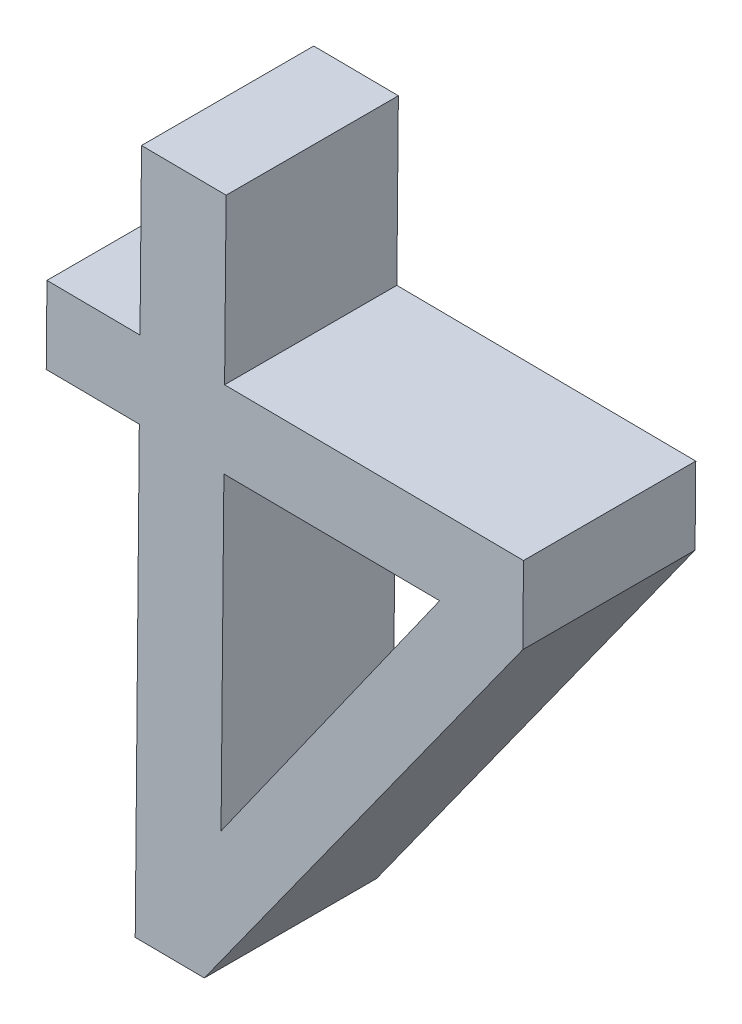
ISO-10303-21;
HEADER;
FILE_DESCRIPTION(('STEP AP214'),'2;1');
FILE_NAME('part.step','',(''),(''),'','','');
FILE_SCHEMA(('AUTOMOTIVE_DESIGN { 1 0 10303 214 1 1 1 1 }'));
ENDSEC;
DATA;
#1=APPLICATION_CONTEXT('core data for automotive mechanical design processes');
#2=APPLICATION_PROTOCOL_DEFINITION('international standard','automotive_design',2000,#1);
#3=PRODUCT_CONTEXT('',#1,'mechanical');
#4=PRODUCT('Part','Part','',(#3));
#5=PRODUCT_RELATED_PRODUCT_CATEGORY('part','',(#4));
#6=PRODUCT_DEFINITION_FORMATION('','',#4);
#7=PRODUCT_DEFINITION_CONTEXT('part definition',#1,'design');
#8=PRODUCT_DEFINITION('design','',#6,#7);
#9=PRODUCT_DEFINITION_SHAPE('','',#8);
#10=(LENGTH_UNIT() NAMED_UNIT(*) SI_UNIT(.MILLI.,.METRE.));
#11=(NAMED_UNIT(*) PLANE_ANGLE_UNIT() SI_UNIT($,.RADIAN.));
#12=(NAMED_UNIT(*) SI_UNIT($,.STERADIAN.) SOLID_ANGLE_UNIT());
#13=UNCERTAINTY_MEASURE_WITH_UNIT(LENGTH_MEASURE(1.E-05),#10,'distance_accuracy_value','');
#14=(GEOMETRIC_REPRESENTATION_CONTEXT(3) GLOBAL_UNCERTAINTY_ASSIGNED_CONTEXT((#13)) GLOBAL_UNIT_ASSIGNED_CONTEXT((#10,
#11,#12)) REPRESENTATION_CONTEXT('',''));
#15=CARTESIAN_POINT('',(0.,0.,0.));
#16=DIRECTION('',(0.,0.,1.));
#17=DIRECTION('',(1.,0.,0.));
#18=AXIS2_PLACEMENT_3D('',#15,#16,#17);
#19=CARTESIAN_POINT('',(-3.06686875758942,7.66803491305497,0.));
#20=DIRECTION('',(0.999958242624415,-0.00913854515184332,0.));
#21=DIRECTION('',(0.,0.,-1.));
#22=AXIS2_PLACEMENT_3D('',#19,#20,#21);
#23=PLANE('',#22);
#24=DIRECTION('',(-0.00913854515184332,-0.999958242624415,0.));
#25=VECTOR('',#24,1.);
#26=CARTESIAN_POINT('',(-3.06274830833733,8.11890287119014,0.));
#27=LINE('',#26,#25);
#28=CARTESIAN_POINT('',(-3.06274830833733,8.11890287119014,0.));
#29=VERTEX_POINT('',#28);
#30=CARTESIAN_POINT('',(-3.06686875758942,7.66803491305497,0.));
#31=VERTEX_POINT('',#30);
#32=EDGE_CURVE('E208',#29,#31,#27,.T.);
#33=ORIENTED_EDGE('',*,*,#32,.F.);
#34=DIRECTION('',(0.,0.,1.));
#35=VECTOR('',#34,1.);
#36=CARTESIAN_POINT('',(-3.06274830833733,8.11890287119014,0.));
#37=LINE('',#36,#35);
#38=CARTESIAN_POINT('',(-3.06274830833733,8.11890287119014,0.25));
#39=VERTEX_POINT('',#38);
#40=EDGE_CURVE('E138',#29,#39,#37,.T.);
#41=ORIENTED_EDGE('',*,*,#40,.T.);
#42=DIRECTION('',(0.00913854515184332,0.999958242624415,0.));
#43=VECTOR('',#42,1.);
#44=CARTESIAN_POINT('',(-3.06274830833733,8.11890287119014,0.25));
#45=LINE('',#44,#43);
#46=CARTESIAN_POINT('',(-3.06686875758942,7.66803491305497,0.25));
#47=VERTEX_POINT('',#46);
#48=EDGE_CURVE('E20',#47,#39,#45,.T.);
#49=ORIENTED_EDGE('',*,*,#48,.F.);
#50=DIRECTION('',(0.,0.,1.));
#51=VECTOR('',#50,1.);
#52=CARTESIAN_POINT('',(-3.06686875758942,7.66803491305497,0.));
#53=LINE('',#52,#51);
#54=EDGE_CURVE('E27',#31,#47,#53,.T.);
#55=ORIENTED_EDGE('',*,*,#54,.F.);
#56=EDGE_LOOP('',(#33,#41,#49,#55));
#57=FACE_BOUND('',#56,.T.);
#58=ADVANCED_FACE('F16',(#57),#23,.T.);
#59=CARTESIAN_POINT('',(-2.62893282499929,8.11493826325647,0.));
#60=DIRECTION('',(0.999958242624415,-0.00913854515184249,0.));
#61=DIRECTION('',(0.,0.,-1.));
#62=AXIS2_PLACEMENT_3D('',#59,#60,#61);
#63=PLANE('',#62);
#64=DIRECTION('',(-0.00913854515184249,-0.999958242624415,0.));
#65=VECTOR('',#64,1.);
#66=CARTESIAN_POINT('',(-2.62790427188927,8.22748464161916,0.));
#67=LINE('',#66,#65);
#68=CARTESIAN_POINT('',(-2.62790427188927,8.22748464161917,0.));
#69=VERTEX_POINT('',#68);
#70=CARTESIAN_POINT('',(-2.62893282499929,8.11493826325647,0.));
#71=VERTEX_POINT('',#70);
#72=EDGE_CURVE('E169',#69,#71,#67,.T.);
#73=ORIENTED_EDGE('',*,*,#72,.F.);
#74=DIRECTION('',(0.,0.,1.));
#75=VECTOR('',#74,1.);
#76=CARTESIAN_POINT('',(-2.62790427188927,8.22748464161917,0.));
#77=LINE('',#76,#75);
#78=CARTESIAN_POINT('',(-2.62790427188927,8.22748464161917,0.25));
#79=VERTEX_POINT('',#78);
#80=EDGE_CURVE('E11',#69,#79,#77,.T.);
#81=ORIENTED_EDGE('',*,*,#80,.T.);
#82=DIRECTION('',(0.00913854515184249,0.999958242624415,0.));
#83=VECTOR('',#82,1.);
#84=CARTESIAN_POINT('',(-2.62790427188927,8.22748464161916,0.25));
#85=LINE('',#84,#83);
#86=CARTESIAN_POINT('',(-2.62893282499929,8.11493826325647,0.25));
#87=VERTEX_POINT('',#86);
#88=EDGE_CURVE('E184',#87,#79,#85,.T.);
#89=ORIENTED_EDGE('',*,*,#88,.F.);
#90=DIRECTION('',(0.,0.,1.));
#91=VECTOR('',#90,1.);
#92=CARTESIAN_POINT('',(-2.62893282499929,8.11493826325647,0.));
#93=LINE('',#92,#91);
#94=EDGE_CURVE('E209',#71,#87,#93,.T.);
#95=ORIENTED_EDGE('',*,*,#94,.F.);
#96=EDGE_LOOP('',(#73,#81,#89,#95));
#97=FACE_BOUND('',#96,.T.);
#98=ADVANCED_FACE('F653',(#97),#63,.T.);
#99=CARTESIAN_POINT('',(-2.62790427188927,8.22748464161917,0.));
#100=DIRECTION('',(0.00913854515184178,0.999958242624415,0.));
#101=DIRECTION('',(0.,0.,-1.));
#102=AXIS2_PLACEMENT_3D('',#99,#100,#101);
#103=PLANE('',#102);
#104=DIRECTION('',(0.999958242624415,-0.00913854515184178,0.));
#105=VECTOR('',#104,1.);
#106=CARTESIAN_POINT('',(-3.06171975522731,8.23144924955284,0.));
#107=LINE('',#106,#105);
#108=CARTESIAN_POINT('',(-3.06171975522731,8.23144924955284,0.));
#109=VERTEX_POINT('',#108);
#110=EDGE_CURVE('E137',#109,#69,#107,.T.);
#111=ORIENTED_EDGE('',*,*,#110,.F.);
#112=DIRECTION('',(0.,0.,1.));
#113=VECTOR('',#112,1.);
#114=CARTESIAN_POINT('',(-3.06171975522731,8.23144924955284,0.));
#115=LINE('',#114,#113);
#116=CARTESIAN_POINT('',(-3.06171975522731,8.23144924955284,0.25));
#117=VERTEX_POINT('',#116);
#118=EDGE_CURVE('E149',#109,#117,#115,.T.);
#119=ORIENTED_EDGE('',*,*,#118,.T.);
#120=DIRECTION('',(-0.999958242624415,0.00913854515184178,0.));
#121=VECTOR('',#120,1.);
#122=CARTESIAN_POINT('',(-3.06171975522731,8.23144924955284,0.25));
#123=LINE('',#122,#121);
#124=EDGE_CURVE('E271',#79,#117,#123,.T.);
#125=ORIENTED_EDGE('',*,*,#124,.F.);
#126=ORIENTED_EDGE('',*,*,#80,.F.);
#127=EDGE_LOOP('',(#111,#119,#125,#126));
#128=FACE_BOUND('',#127,.T.);
#129=ADVANCED_FACE('F657',(#128),#103,.T.);
#130=CARTESIAN_POINT('',(-3.18449781217529,8.23257130922418,0.));
#131=DIRECTION('',(0.00913854515184391,0.999958242624415,0.));
#132=DIRECTION('',(0.,0.,-1.));
#133=AXIS2_PLACEMENT_3D('',#130,#131,#132);
#134=PLANE('',#133);
#135=DIRECTION('',(0.999958242624415,-0.00913854515184391,0.));
#136=VECTOR('',#135,1.);
#137=CARTESIAN_POINT('',(-3.31955331720514,8.23380557159446,0.));
#138=LINE('',#137,#136);
#139=CARTESIAN_POINT('',(-3.31955331720514,8.23380557159446,0.));
#140=VERTEX_POINT('',#139);
#141=CARTESIAN_POINT('',(-3.18449781217529,8.23257130922418,0.));
#142=VERTEX_POINT('',#141);
#143=EDGE_CURVE('E171',#140,#142,#138,.T.);
#144=ORIENTED_EDGE('',*,*,#143,.F.);
#145=DIRECTION('',(0.,0.,1.));
#146=VECTOR('',#145,1.);
#147=CARTESIAN_POINT('',(-3.31955331720514,8.23380557159446,0.));
#148=LINE('',#147,#146);
#149=CARTESIAN_POINT('',(-3.31955331720514,8.23380557159446,0.25));
#150=VERTEX_POINT('',#149);
#151=EDGE_CURVE('E154',#140,#150,#148,.T.);
#152=ORIENTED_EDGE('',*,*,#151,.T.);
#153=DIRECTION('',(-0.999958242624415,0.00913854515184391,0.));
#154=VECTOR('',#153,1.);
#155=CARTESIAN_POINT('',(-3.31955331720514,8.23380557159446,0.25));
#156=LINE('',#155,#154);
#157=CARTESIAN_POINT('',(-3.18449781217529,8.23257130922418,0.25));
#158=VERTEX_POINT('',#157);
#159=EDGE_CURVE('E205',#158,#150,#156,.T.);
#160=ORIENTED_EDGE('',*,*,#159,.F.);
#161=DIRECTION('',(0.,0.,1.));
#162=VECTOR('',#161,1.);
#163=CARTESIAN_POINT('',(-3.18449781217529,8.23257130922418,0.));
#164=LINE('',#163,#162);
#165=EDGE_CURVE('E174',#142,#158,#164,.T.);
#166=ORIENTED_EDGE('',*,*,#165,.F.);
#167=EDGE_LOOP('',(#144,#152,#160,#166));
#168=FACE_BOUND('',#167,.T.);
#169=ADVANCED_FACE('F690',(#168),#134,.T.);
#170=CARTESIAN_POINT('',(-2.74966473993723,8.11604162338582,0.));
#171=DIRECTION('',(-0.816139664727601,0.577854694242695,0.));
#172=DIRECTION('',(0.,0.,1.));
#173=AXIS2_PLACEMENT_3D('',#170,#171,#172);
#174=PLANE('',#173);
#175=DIRECTION('',(0.577854694242695,0.816139664727601,0.));
#176=VECTOR('',#175,1.);
#177=CARTESIAN_POINT('',(-3.06686875758942,7.66803491305497,0.));
#178=LINE('',#177,#176);
#179=CARTESIAN_POINT('',(-2.74966473993723,8.11604162338582,0.));
#180=VERTEX_POINT('',#179);
#181=EDGE_CURVE('E233',#31,#180,#178,.T.);
#182=ORIENTED_EDGE('',*,*,#181,.F.);
#183=ORIENTED_EDGE('',*,*,#54,.T.);
#184=DIRECTION('',(-0.577854694242695,-0.816139664727601,0.));
#185=VECTOR('',#184,1.);
#186=CARTESIAN_POINT('',(-3.06686875758942,7.66803491305497,0.25));
#187=LINE('',#186,#185);
#188=CARTESIAN_POINT('',(-2.74966473993723,8.11604162338582,0.25));
#189=VERTEX_POINT('',#188);
#190=EDGE_CURVE('E257',#189,#47,#187,.T.);
#191=ORIENTED_EDGE('',*,*,#190,.F.);
#192=DIRECTION('',(0.,0.,1.));
#193=VECTOR('',#192,1.);
#194=CARTESIAN_POINT('',(-2.74966473993723,8.11604162338582,0.));
#195=LINE('',#194,#193);
#196=EDGE_CURVE('E194',#180,#189,#195,.T.);
#197=ORIENTED_EDGE('',*,*,#196,.F.);
#198=EDGE_LOOP('',(#182,#183,#191,#197));
#199=FACE_BOUND('',#198,.T.);
#200=ADVANCED_FACE('F299',(#199),#174,.T.);
#201=CARTESIAN_POINT('',(-3.05953173995759,8.47086634139709,0.));
#202=DIRECTION('',(0.0091385451518386,0.999958242624415,0.));
#203=DIRECTION('',(0.,0.,-1.));
#204=AXIS2_PLACEMENT_3D('',#201,#202,#203);
#205=PLANE('',#204);
#206=DIRECTION('',(0.999958242624415,-0.0091385451518386,0.));
#207=VECTOR('',#206,1.);
#208=CARTESIAN_POINT('',(-3.18230979690557,8.47198840106843,0.));
#209=LINE('',#208,#207);
#210=CARTESIAN_POINT('',(-3.18230979690557,8.47198840106843,0.));
#211=VERTEX_POINT('',#210);
#212=CARTESIAN_POINT('',(-3.05953173995759,8.47086634139709,0.));
#213=VERTEX_POINT('',#212);
#214=EDGE_CURVE('E125',#211,#213,#209,.T.);
#215=ORIENTED_EDGE('',*,*,#214,.F.);
#216=DIRECTION('',(0.,0.,1.));
#217=VECTOR('',#216,1.);
#218=CARTESIAN_POINT('',(-3.18230979690557,8.47198840106843,0.));
#219=LINE('',#218,#217);
#220=CARTESIAN_POINT('',(-3.18230979690557,8.47198840106843,0.25));
#221=VERTEX_POINT('',#220);
#222=EDGE_CURVE('E193',#211,#221,#219,.T.);
#223=ORIENTED_EDGE('',*,*,#222,.T.);
#224=DIRECTION('',(-0.999958242624415,0.0091385451518386,0.));
#225=VECTOR('',#224,1.);
#226=CARTESIAN_POINT('',(-3.18230979690557,8.47198840106843,0.25));
#227=LINE('',#226,#225);
#228=CARTESIAN_POINT('',(-3.05953173995759,8.47086634139709,0.25));
#229=VERTEX_POINT('',#228);
#230=EDGE_CURVE('E144',#229,#221,#227,.T.);
#231=ORIENTED_EDGE('',*,*,#230,.F.);
#232=DIRECTION('',(0.,0.,1.));
#233=VECTOR('',#232,1.);
#234=CARTESIAN_POINT('',(-3.05953173995759,8.47086634139709,0.));
#235=LINE('',#234,#233);
#236=EDGE_CURVE('E141',#213,#229,#235,.T.);
#237=ORIENTED_EDGE('',*,*,#236,.F.);
#238=EDGE_LOOP('',(#215,#223,#231,#237));
#239=FACE_BOUND('',#238,.T.);
#240=ADVANCED_FACE('F142',(#239),#205,.T.);
#241=CARTESIAN_POINT('',(0.0434994918093968,7.94596675152105,0.));
#242=DIRECTION('',(0.,0.,1.));
#243=DIRECTION('',(1.,0.,0.));
#244=AXIS2_PLACEMENT_3D('',#241,#242,#243);
#245=PLANE('',#244);
#246=DIRECTION('',(-0.999958242624415,0.00913854515184165,0.));
#247=VECTOR('',#246,1.);
#248=CARTESIAN_POINT('',(-2.74966473993723,8.11604162338582,0.));
#249=LINE('',#248,#247);
#250=EDGE_CURVE('E198',#180,#29,#249,.T.);
#251=ORIENTED_EDGE('',*,*,#250,.T.);
#252=ORIENTED_EDGE('',*,*,#32,.T.);
#253=ORIENTED_EDGE('',*,*,#181,.T.);
#254=EDGE_LOOP('',(#251,#252,#253));
#255=FACE_BOUND('',#254,.T.);
#256=ORIENTED_EDGE('',*,*,#214,.T.);
#257=DIRECTION('',(-0.00913854515184424,-0.999958242624415,0.));
#258=VECTOR('',#257,1.);
#259=CARTESIAN_POINT('',(-3.05953173995759,8.47086634139709,0.));
#260=LINE('',#259,#258);
#261=EDGE_CURVE('E130',#213,#109,#260,.T.);
#262=ORIENTED_EDGE('',*,*,#261,.T.);
#263=ORIENTED_EDGE('',*,*,#110,.T.);
#264=ORIENTED_EDGE('',*,*,#72,.T.);
#265=DIRECTION('',(-0.583218321463091,-0.81231544950824,0.));
#266=VECTOR('',#265,1.);
#267=CARTESIAN_POINT('',(-2.6289328249993,8.11493826325647,0.));
#268=LINE('',#267,#266);
#269=CARTESIAN_POINT('',(-3.09117963542085,7.47111379517502,0.));
#270=VERTEX_POINT('',#269);
#271=EDGE_CURVE('E214',#71,#270,#268,.T.);
#272=ORIENTED_EDGE('',*,*,#271,.T.);
#273=DIRECTION('',(-0.999958242624415,0.00913854515184312,0.));
#274=VECTOR('',#273,1.);
#275=CARTESIAN_POINT('',(-3.09117963542085,7.47111379517502,0.));
#276=LINE('',#275,#274);
#277=CARTESIAN_POINT('',(-3.19144834219359,7.47203014354348,0.));
#278=VERTEX_POINT('',#277);
#279=EDGE_CURVE('E189',#270,#278,#276,.T.);
#280=ORIENTED_EDGE('',*,*,#279,.T.);
#281=DIRECTION('',(0.00913854515184315,0.999958242624415,0.));
#282=VECTOR('',#281,1.);
#283=CARTESIAN_POINT('',(-3.19144834219359,7.47203014354348,0.));
#284=LINE('',#283,#282);
#285=CARTESIAN_POINT('',(-3.18552636528531,8.12002493086149,0.));
#286=VERTEX_POINT('',#285);
#287=EDGE_CURVE('E188',#278,#286,#284,.T.);
#288=ORIENTED_EDGE('',*,*,#287,.T.);
#289=DIRECTION('',(-0.999958242624415,0.00913854515184391,0.));
#290=VECTOR('',#289,1.);
#291=CARTESIAN_POINT('',(-3.18552636528531,8.12002493086149,0.));
#292=LINE('',#291,#290);
#293=CARTESIAN_POINT('',(-3.32058187031516,8.12125919323177,0.));
#294=VERTEX_POINT('',#293);
#295=EDGE_CURVE('E215',#286,#294,#292,.T.);
#296=ORIENTED_EDGE('',*,*,#295,.T.);
#297=DIRECTION('',(0.00913854515184249,0.999958242624415,0.));
#298=VECTOR('',#297,1.);
#299=CARTESIAN_POINT('',(-3.32058187031516,8.12125919323176,0.));
#300=LINE('',#299,#298);
#301=EDGE_CURVE('E163',#294,#140,#300,.T.);
#302=ORIENTED_EDGE('',*,*,#301,.T.);
#303=ORIENTED_EDGE('',*,*,#143,.T.);
#304=DIRECTION('',(0.00913854515184424,0.999958242624415,0.));
#305=VECTOR('',#304,1.);
#306=CARTESIAN_POINT('',(-3.18449781217529,8.23257130922418,0.));
#307=LINE('',#306,#305);
#308=EDGE_CURVE('E133',#142,#211,#307,.T.);
#309=ORIENTED_EDGE('',*,*,#308,.T.);
#310=EDGE_LOOP('',(#256,#262,#263,#264,#272,#280,#288,#296,#302,#303,#309));
#311=FACE_BOUND('',#310,.T.);
#312=ADVANCED_FACE('F127',(#255,#311),#245,.F.);
#313=CARTESIAN_POINT('',(-3.06274830833733,8.11890287119014,0.));
#314=DIRECTION('',(-0.00913854515184165,-0.999958242624415,0.));
#315=DIRECTION('',(-0.999958242624415,0.00913854515184165,0.));
#316=AXIS2_PLACEMENT_3D('',#313,#314,#315);
#317=PLANE('',#316);
#318=ORIENTED_EDGE('',*,*,#250,.F.);
#319=ORIENTED_EDGE('',*,*,#196,.T.);
#320=DIRECTION('',(0.999958242624415,-0.00913854515184165,0.));
#321=VECTOR('',#320,1.);
#322=CARTESIAN_POINT('',(-2.74966473993723,8.11604162338582,0.25));
#323=LINE('',#322,#321);
#324=EDGE_CURVE('E167',#39,#189,#323,.T.);
#325=ORIENTED_EDGE('',*,*,#324,.F.);
#326=ORIENTED_EDGE('',*,*,#40,.F.);
#327=EDGE_LOOP('',(#318,#319,#325,#326));
#328=FACE_BOUND('',#327,.T.);
#329=ADVANCED_FACE('F18',(#328),#317,.T.);
#330=CARTESIAN_POINT('',(-3.06171975522731,8.23144924955284,0.));
#331=DIRECTION('',(0.999958242624415,-0.00913854515184424,0.));
#332=DIRECTION('',(0.,0.,-1.));
#333=AXIS2_PLACEMENT_3D('',#330,#331,#332);
#334=PLANE('',#333);
#335=ORIENTED_EDGE('',*,*,#261,.F.);
#336=ORIENTED_EDGE('',*,*,#236,.T.);
#337=DIRECTION('',(0.00913854515184424,0.999958242624415,0.));
#338=VECTOR('',#337,1.);
#339=CARTESIAN_POINT('',(-3.05953173995759,8.47086634139709,0.25));
#340=LINE('',#339,#338);
#341=EDGE_CURVE('E275',#117,#229,#340,.T.);
#342=ORIENTED_EDGE('',*,*,#341,.F.);
#343=ORIENTED_EDGE('',*,*,#118,.F.);
#344=EDGE_LOOP('',(#335,#336,#342,#343));
#345=FACE_BOUND('',#344,.T.);
#346=ADVANCED_FACE('F152',(#345),#334,.T.);
#347=CARTESIAN_POINT('',(-3.31955331720514,8.23380557159446,0.));
#348=DIRECTION('',(-0.999958242624415,0.00913854515184249,0.));
#349=DIRECTION('',(0.,0.,1.));
#350=AXIS2_PLACEMENT_3D('',#347,#348,#349);
#351=PLANE('',#350);
#352=ORIENTED_EDGE('',*,*,#301,.F.);
#353=DIRECTION('',(0.,0.,1.));
#354=VECTOR('',#353,1.);
#355=CARTESIAN_POINT('',(-3.32058187031516,8.12125919323177,0.));
#356=LINE('',#355,#354);
#357=CARTESIAN_POINT('',(-3.32058187031516,8.12125919323177,0.25));
#358=VERTEX_POINT('',#357);
#359=EDGE_CURVE('E219',#294,#358,#356,.T.);
#360=ORIENTED_EDGE('',*,*,#359,.T.);
#361=DIRECTION('',(-0.00913854515184249,-0.999958242624415,0.));
#362=VECTOR('',#361,1.);
#363=CARTESIAN_POINT('',(-3.32058187031516,8.12125919323176,0.25));
#364=LINE('',#363,#362);
#365=EDGE_CURVE('E249',#150,#358,#364,.T.);
#366=ORIENTED_EDGE('',*,*,#365,.F.);
#367=ORIENTED_EDGE('',*,*,#151,.F.);
#368=EDGE_LOOP('',(#352,#360,#366,#367));
#369=FACE_BOUND('',#368,.T.);
#370=ADVANCED_FACE('F674',(#369),#351,.T.);
#371=CARTESIAN_POINT('',(-3.32058187031516,8.12125919323177,0.));
#372=DIRECTION('',(-0.00913854515184391,-0.999958242624415,0.));
#373=DIRECTION('',(-0.999958242624415,0.00913854515184391,0.));
#374=AXIS2_PLACEMENT_3D('',#371,#372,#373);
#375=PLANE('',#374);
#376=ORIENTED_EDGE('',*,*,#295,.F.);
#377=DIRECTION('',(0.,0.,1.));
#378=VECTOR('',#377,1.);
#379=CARTESIAN_POINT('',(-3.18552636528531,8.12002493086149,0.));
#380=LINE('',#379,#378);
#381=CARTESIAN_POINT('',(-3.18552636528531,8.12002493086149,0.25));
#382=VERTEX_POINT('',#381);
#383=EDGE_CURVE('E220',#286,#382,#380,.T.);
#384=ORIENTED_EDGE('',*,*,#383,.T.);
#385=DIRECTION('',(0.999958242624415,-0.00913854515184391,0.));
#386=VECTOR('',#385,1.);
#387=CARTESIAN_POINT('',(-3.18552636528531,8.12002493086149,0.25));
#388=LINE('',#387,#386);
#389=EDGE_CURVE('E250',#358,#382,#388,.T.);
#390=ORIENTED_EDGE('',*,*,#389,.F.);
#391=ORIENTED_EDGE('',*,*,#359,.F.);
#392=EDGE_LOOP('',(#376,#384,#390,#391));
#393=FACE_BOUND('',#392,.T.);
#394=ADVANCED_FACE('F670',(#393),#375,.T.);
#395=CARTESIAN_POINT('',(-3.18552636528531,8.12002493086149,0.));
#396=DIRECTION('',(-0.999958242624415,0.00913854515184315,0.));
#397=DIRECTION('',(0.,0.,1.));
#398=AXIS2_PLACEMENT_3D('',#395,#396,#397);
#399=PLANE('',#398);
#400=ORIENTED_EDGE('',*,*,#287,.F.);
#401=DIRECTION('',(0.,0.,1.));
#402=VECTOR('',#401,1.);
#403=CARTESIAN_POINT('',(-3.19144834219359,7.47203014354348,0.));
#404=LINE('',#403,#402);
#405=CARTESIAN_POINT('',(-3.19144834219359,7.47203014354348,0.25));
#406=VERTEX_POINT('',#405);
#407=EDGE_CURVE('E185',#278,#406,#404,.T.);
#408=ORIENTED_EDGE('',*,*,#407,.T.);
#409=DIRECTION('',(-0.00913854515184315,-0.999958242624415,0.));
#410=VECTOR('',#409,1.);
#411=CARTESIAN_POINT('',(-3.19144834219359,7.47203014354348,0.25));
#412=LINE('',#411,#410);
#413=EDGE_CURVE('E180',#382,#406,#412,.T.);
#414=ORIENTED_EDGE('',*,*,#413,.F.);
#415=ORIENTED_EDGE('',*,*,#383,.F.);
#416=EDGE_LOOP('',(#400,#408,#414,#415));
#417=FACE_BOUND('',#416,.T.);
#418=ADVANCED_FACE('F647',(#417),#399,.T.);
#419=CARTESIAN_POINT('',(-3.19144834219359,7.47203014354348,0.));
#420=DIRECTION('',(-0.00913854515184312,-0.999958242624415,0.));
#421=DIRECTION('',(-0.999958242624415,0.00913854515184312,0.));
#422=AXIS2_PLACEMENT_3D('',#419,#420,#421);
#423=PLANE('',#422);
#424=ORIENTED_EDGE('',*,*,#279,.F.);
#425=DIRECTION('',(0.,0.,1.));
#426=VECTOR('',#425,1.);
#427=CARTESIAN_POINT('',(-3.09117963542085,7.47111379517502,0.));
#428=LINE('',#427,#426);
#429=CARTESIAN_POINT('',(-3.09117963542085,7.47111379517502,0.25));
#430=VERTEX_POINT('',#429);
#431=EDGE_CURVE('E213',#270,#430,#428,.T.);
#432=ORIENTED_EDGE('',*,*,#431,.T.);
#433=DIRECTION('',(0.999958242624415,-0.00913854515184312,0.));
#434=VECTOR('',#433,1.);
#435=CARTESIAN_POINT('',(-3.09117963542085,7.47111379517502,0.25));
#436=LINE('',#435,#434);
#437=EDGE_CURVE('E175',#406,#430,#436,.T.);
#438=ORIENTED_EDGE('',*,*,#437,.F.);
#439=ORIENTED_EDGE('',*,*,#407,.F.);
#440=EDGE_LOOP('',(#424,#432,#438,#439));
#441=FACE_BOUND('',#440,.T.);
#442=ADVANCED_FACE('F608',(#441),#423,.T.);
#443=CARTESIAN_POINT('',(-3.09117963542085,7.47111379517502,0.));
#444=DIRECTION('',(0.81231544950824,-0.583218321463092,0.));
#445=DIRECTION('',(0.,0.,-1.));
#446=AXIS2_PLACEMENT_3D('',#443,#444,#445);
#447=PLANE('',#446);
#448=ORIENTED_EDGE('',*,*,#271,.F.);
#449=ORIENTED_EDGE('',*,*,#94,.T.);
#450=DIRECTION('',(0.583218321463091,0.81231544950824,0.));
#451=VECTOR('',#450,1.);
#452=CARTESIAN_POINT('',(-2.6289328249993,8.11493826325647,0.25));
#453=LINE('',#452,#451);
#454=EDGE_CURVE('E179',#430,#87,#453,.T.);
#455=ORIENTED_EDGE('',*,*,#454,.F.);
#456=ORIENTED_EDGE('',*,*,#431,.F.);
#457=EDGE_LOOP('',(#448,#449,#455,#456));
#458=FACE_BOUND('',#457,.T.);
#459=ADVANCED_FACE('F603',(#458),#447,.T.);
#460=CARTESIAN_POINT('',(-3.18230979690557,8.47198840106843,0.));
#461=DIRECTION('',(-0.999958242624415,0.00913854515184424,0.));
#462=DIRECTION('',(0.,0.,1.));
#463=AXIS2_PLACEMENT_3D('',#460,#461,#462);
#464=PLANE('',#463);
#465=ORIENTED_EDGE('',*,*,#308,.F.);
#466=ORIENTED_EDGE('',*,*,#165,.T.);
#467=DIRECTION('',(-0.00913854515184424,-0.999958242624415,0.));
#468=VECTOR('',#467,1.);
#469=CARTESIAN_POINT('',(-3.18449781217529,8.23257130922418,0.25));
#470=LINE('',#469,#468);
#471=EDGE_CURVE('E201',#221,#158,#470,.T.);
#472=ORIENTED_EDGE('',*,*,#471,.F.);
#473=ORIENTED_EDGE('',*,*,#222,.F.);
#474=EDGE_LOOP('',(#465,#466,#472,#473));
#475=FACE_BOUND('',#474,.T.);
#476=ADVANCED_FACE('F607',(#475),#464,.T.);
#477=CARTESIAN_POINT('',(0.0434994918093968,7.94596675152105,0.25));
#478=DIRECTION('',(0.,0.,1.));
#479=DIRECTION('',(1.,0.,0.));
#480=AXIS2_PLACEMENT_3D('',#477,#478,#479);
#481=PLANE('',#480);
#482=ORIENTED_EDGE('',*,*,#324,.T.);
#483=ORIENTED_EDGE('',*,*,#190,.T.);
#484=ORIENTED_EDGE('',*,*,#48,.T.);
#485=EDGE_LOOP('',(#482,#483,#484));
#486=FACE_BOUND('',#485,.T.);
#487=ORIENTED_EDGE('',*,*,#230,.T.);
#488=ORIENTED_EDGE('',*,*,#471,.T.);
#489=ORIENTED_EDGE('',*,*,#159,.T.);
#490=ORIENTED_EDGE('',*,*,#365,.T.);
#491=ORIENTED_EDGE('',*,*,#389,.T.);
#492=ORIENTED_EDGE('',*,*,#413,.T.);
#493=ORIENTED_EDGE('',*,*,#437,.T.);
#494=ORIENTED_EDGE('',*,*,#454,.T.);
#495=ORIENTED_EDGE('',*,*,#88,.T.);
#496=ORIENTED_EDGE('',*,*,#124,.T.);
#497=ORIENTED_EDGE('',*,*,#341,.T.);
#498=EDGE_LOOP('',(#487,#488,#489,#490,#491,#492,#493,#494,#495,#496,#497));
#499=FACE_BOUND('',#498,.T.);
#500=ADVANCED_FACE('F290',(#486,#499),#481,.T.);
#501=CLOSED_SHELL('',(#58,#98,#129,#169,#200,#240,#312,#329,#346,#370,#394,#418,#442,#459,#476,#500));
#502=MANIFOLD_SOLID_BREP('B1',#501);
#503=ADVANCED_BREP_SHAPE_REPRESENTATION('',(#18,#502),#14);
#504=SHAPE_DEFINITION_REPRESENTATION(#9,#503);
ENDSEC;
END-ISO-10303-21;
